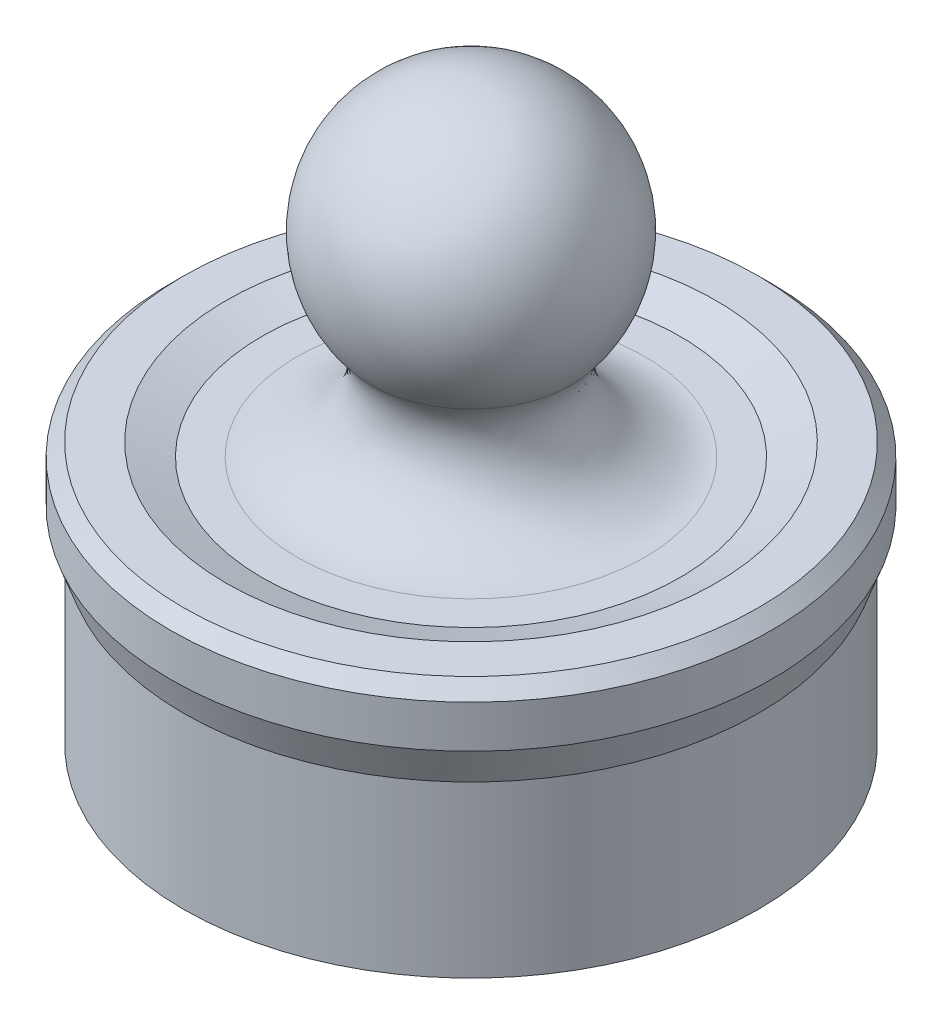
ISO-10303-21;
HEADER;
FILE_DESCRIPTION(('STEP AP214'),'2;1');
FILE_NAME('part.step','',(''),(''),'','','');
FILE_SCHEMA(('AUTOMOTIVE_DESIGN { 1 0 10303 214 1 1 1 1 }'));
ENDSEC;
DATA;
#1=APPLICATION_CONTEXT('core data for automotive mechanical design processes');
#2=APPLICATION_PROTOCOL_DEFINITION('international standard','automotive_design',2000,#1);
#3=PRODUCT_CONTEXT('',#1,'mechanical');
#4=PRODUCT('Part','Part','',(#3));
#5=PRODUCT_RELATED_PRODUCT_CATEGORY('part','',(#4));
#6=PRODUCT_DEFINITION_FORMATION('','',#4);
#7=PRODUCT_DEFINITION_CONTEXT('part definition',#1,'design');
#8=PRODUCT_DEFINITION('design','',#6,#7);
#9=PRODUCT_DEFINITION_SHAPE('','',#8);
#10=(LENGTH_UNIT() NAMED_UNIT(*) SI_UNIT(.MILLI.,.METRE.));
#11=(NAMED_UNIT(*) PLANE_ANGLE_UNIT() SI_UNIT($,.RADIAN.));
#12=(NAMED_UNIT(*) SI_UNIT($,.STERADIAN.) SOLID_ANGLE_UNIT());
#13=UNCERTAINTY_MEASURE_WITH_UNIT(LENGTH_MEASURE(1.E-05),#10,'distance_accuracy_value','');
#14=(GEOMETRIC_REPRESENTATION_CONTEXT(3) GLOBAL_UNCERTAINTY_ASSIGNED_CONTEXT((#13)) GLOBAL_UNIT_ASSIGNED_CONTEXT((#10,
#11,#12)) REPRESENTATION_CONTEXT('',''));
#15=CARTESIAN_POINT('',(0.,0.,0.));
#16=DIRECTION('',(0.,0.,1.));
#17=DIRECTION('',(1.,0.,0.));
#18=AXIS2_PLACEMENT_3D('',#15,#16,#17);
#19=CARTESIAN_POINT('',(-9.,-7.5,0.));
#20=DIRECTION('',(0.,-1.,0.));
#21=DIRECTION('',(0.,0.,-1.));
#22=AXIS2_PLACEMENT_3D('',#19,#20,#21);
#23=PLANE('',#22);
#24=CARTESIAN_POINT('',(0.,-7.5,0.));
#25=DIRECTION('',(0.,1.,0.));
#26=DIRECTION('',(0.,0.,1.));
#27=AXIS2_PLACEMENT_3D('',#24,#25,#26);
#28=CIRCLE('',#27,9.);
#29=CARTESIAN_POINT('',(0.,-7.5,9.));
#30=VERTEX_POINT('',#29);
#31=EDGE_CURVE('E72',#30,#30,#28,.T.);
#32=ORIENTED_EDGE('',*,*,#31,.T.);
#33=EDGE_LOOP('',(#32));
#34=FACE_BOUND('',#33,.T.);
#35=CARTESIAN_POINT('',(0.,-7.5,0.));
#36=DIRECTION('',(0.,1.,0.));
#37=DIRECTION('',(0.,0.,1.));
#38=AXIS2_PLACEMENT_3D('',#35,#36,#37);
#39=CIRCLE('',#38,11.);
#40=CARTESIAN_POINT('',(0.,-7.5,11.));
#41=VERTEX_POINT('',#40);
#42=EDGE_CURVE('E10',#41,#41,#39,.T.);
#43=ORIENTED_EDGE('',*,*,#42,.F.);
#44=EDGE_LOOP('',(#43));
#45=FACE_BOUND('',#44,.T.);
#46=ADVANCED_FACE('F35',(#34,#45),#23,.T.);
#47=CARTESIAN_POINT('',(0.,14.5,0.));
#48=DIRECTION('',(0.,1.,0.));
#49=DIRECTION('',(0.,0.,1.));
#50=AXIS2_PLACEMENT_3D('',#47,#48,#49);
#51=CYLINDRICAL_SURFACE('',#50,11.);
#52=ORIENTED_EDGE('',*,*,#42,.T.);
#53=EDGE_LOOP('',(#52));
#54=FACE_BOUND('',#53,.T.);
#55=CARTESIAN_POINT('',(0.,-0.999999999999999,0.));
#56=DIRECTION('',(0.,1.,0.));
#57=DIRECTION('',(0.,0.,1.));
#58=AXIS2_PLACEMENT_3D('',#55,#56,#57);
#59=CIRCLE('',#58,11.);
#60=CARTESIAN_POINT('',(0.,-0.999999999999999,11.));
#61=VERTEX_POINT('',#60);
#62=EDGE_CURVE('E41',#61,#61,#59,.T.);
#63=ORIENTED_EDGE('',*,*,#62,.F.);
#64=EDGE_LOOP('',(#63));
#65=FACE_BOUND('',#64,.T.);
#66=ADVANCED_FACE('F111',(#54,#65),#51,.T.);
#67=CARTESIAN_POINT('',(0.,0.373738709727334,0.));
#68=DIRECTION('',(0.,1.,0.));
#69=DIRECTION('',(0.,0.,1.));
#70=AXIS2_PLACEMENT_3D('',#67,#68,#69);
#71=CONICAL_SURFACE('',#70,11.5,0.349065850398871);
#72=ORIENTED_EDGE('',*,*,#62,.T.);
#73=EDGE_LOOP('',(#72));
#74=FACE_BOUND('',#73,.T.);
#75=CARTESIAN_POINT('',(0.,0.373738709727334,0.));
#76=DIRECTION('',(0.,1.,0.));
#77=DIRECTION('',(0.,0.,1.));
#78=AXIS2_PLACEMENT_3D('',#75,#76,#77);
#79=CIRCLE('',#78,11.5);
#80=CARTESIAN_POINT('',(0.,0.373738709727334,11.5));
#81=VERTEX_POINT('',#80);
#82=EDGE_CURVE('E45',#81,#81,#79,.T.);
#83=ORIENTED_EDGE('',*,*,#82,.F.);
#84=EDGE_LOOP('',(#83));
#85=FACE_BOUND('',#84,.T.);
#86=ADVANCED_FACE('F108',(#74,#85),#71,.T.);
#87=CARTESIAN_POINT('',(0.,14.5,0.));
#88=DIRECTION('',(0.,1.,0.));
#89=DIRECTION('',(0.,0.,1.));
#90=AXIS2_PLACEMENT_3D('',#87,#88,#89);
#91=CYLINDRICAL_SURFACE('',#90,11.5);
#92=ORIENTED_EDGE('',*,*,#82,.T.);
#93=EDGE_LOOP('',(#92));
#94=FACE_BOUND('',#93,.T.);
#95=CARTESIAN_POINT('',(0.,2.00000000000001,0.));
#96=DIRECTION('',(0.,1.,0.));
#97=DIRECTION('',(0.,0.,1.));
#98=AXIS2_PLACEMENT_3D('',#95,#96,#97);
#99=CIRCLE('',#98,11.5);
#100=CARTESIAN_POINT('',(0.,2.00000000000001,11.5));
#101=VERTEX_POINT('',#100);
#102=EDGE_CURVE('E49',#101,#101,#99,.T.);
#103=ORIENTED_EDGE('',*,*,#102,.F.);
#104=EDGE_LOOP('',(#103));
#105=FACE_BOUND('',#104,.T.);
#106=ADVANCED_FACE('F104',(#94,#105),#91,.T.);
#107=CARTESIAN_POINT('',(0.,2.5,0.));
#108=DIRECTION('',(0.,-1.,0.));
#109=DIRECTION('',(0.,0.,-1.));
#110=AXIS2_PLACEMENT_3D('',#107,#108,#109);
#111=CONICAL_SURFACE('',#110,11.,0.785398163397443);
#112=ORIENTED_EDGE('',*,*,#102,.T.);
#113=EDGE_LOOP('',(#112));
#114=FACE_BOUND('',#113,.T.);
#115=CARTESIAN_POINT('',(0.,2.5,0.));
#116=DIRECTION('',(0.,1.,0.));
#117=DIRECTION('',(0.,0.,1.));
#118=AXIS2_PLACEMENT_3D('',#115,#116,#117);
#119=CIRCLE('',#118,11.);
#120=CARTESIAN_POINT('',(0.,2.5,11.));
#121=VERTEX_POINT('',#120);
#122=EDGE_CURVE('E54',#121,#121,#119,.T.);
#123=ORIENTED_EDGE('',*,*,#122,.F.);
#124=EDGE_LOOP('',(#123));
#125=FACE_BOUND('',#124,.T.);
#126=ADVANCED_FACE('F100',(#114,#125),#111,.T.);
#127=CARTESIAN_POINT('',(-9.37373870972734,2.5,0.));
#128=DIRECTION('',(0.,1.,0.));
#129=DIRECTION('',(0.,0.,1.));
#130=AXIS2_PLACEMENT_3D('',#127,#128,#129);
#131=PLANE('',#130);
#132=ORIENTED_EDGE('',*,*,#122,.T.);
#133=EDGE_LOOP('',(#132));
#134=FACE_BOUND('',#133,.T.);
#135=CARTESIAN_POINT('',(0.,2.5,0.));
#136=DIRECTION('',(0.,1.,0.));
#137=DIRECTION('',(0.,0.,1.));
#138=AXIS2_PLACEMENT_3D('',#135,#136,#137);
#139=CIRCLE('',#138,9.37373870972734);
#140=CARTESIAN_POINT('',(0.,2.5,9.37373870972734));
#141=VERTEX_POINT('',#140);
#142=EDGE_CURVE('E57',#141,#141,#139,.T.);
#143=ORIENTED_EDGE('',*,*,#142,.F.);
#144=EDGE_LOOP('',(#143));
#145=FACE_BOUND('',#144,.T.);
#146=ADVANCED_FACE('F96',(#134,#145),#131,.T.);
#147=CARTESIAN_POINT('',(0.,2.,0.));
#148=DIRECTION('',(0.,1.,0.));
#149=DIRECTION('',(0.,0.,1.));
#150=AXIS2_PLACEMENT_3D('',#147,#148,#149);
#151=CONICAL_SURFACE('',#150,8.,1.22173047639604);
#152=ORIENTED_EDGE('',*,*,#142,.T.);
#153=EDGE_LOOP('',(#152));
#154=FACE_BOUND('',#153,.T.);
#155=CARTESIAN_POINT('',(0.,2.,0.));
#156=DIRECTION('',(0.,1.,0.));
#157=DIRECTION('',(0.,0.,1.));
#158=AXIS2_PLACEMENT_3D('',#155,#156,#157);
#159=CIRCLE('',#158,8.);
#160=CARTESIAN_POINT('',(0.,2.,8.));
#161=VERTEX_POINT('',#160);
#162=EDGE_CURVE('E60',#161,#161,#159,.T.);
#163=ORIENTED_EDGE('',*,*,#162,.F.);
#164=EDGE_LOOP('',(#163));
#165=FACE_BOUND('',#164,.T.);
#166=ADVANCED_FACE('F92',(#154,#165),#151,.F.);
#167=CARTESIAN_POINT('',(-8.,2.,0.));
#168=DIRECTION('',(0.,1.,0.));
#169=DIRECTION('',(0.,0.,1.));
#170=AXIS2_PLACEMENT_3D('',#167,#168,#169);
#171=PLANE('',#170);
#172=ORIENTED_EDGE('',*,*,#162,.T.);
#173=EDGE_LOOP('',(#172));
#174=FACE_BOUND('',#173,.T.);
#175=CARTESIAN_POINT('',(0.,1.99999999999999,0.));
#176=DIRECTION('',(0.,1.,0.));
#177=DIRECTION('',(0.,0.,1.));
#178=AXIS2_PLACEMENT_3D('',#175,#176,#177);
#179=CIRCLE('',#178,6.65525862764819);
#180=CARTESIAN_POINT('',(0.,1.99999999999999,6.65525862764819));
#181=VERTEX_POINT('',#180);
#182=EDGE_CURVE('E63',#181,#181,#179,.T.);
#183=ORIENTED_EDGE('',*,*,#182,.F.);
#184=EDGE_LOOP('',(#183));
#185=FACE_BOUND('',#184,.T.);
#186=ADVANCED_FACE('F87',(#174,#185),#171,.T.);
#187=CARTESIAN_POINT('',(-3.84504348942107,6.30380842807245,0.));
#188=CARTESIAN_POINT('',(-2.95736250864117,5.23592125703775,0.));
#189=CARTESIAN_POINT('',(-3.57690890251755,3.35585886970705,0.));
#190=CARTESIAN_POINT('',(-5.25049025224121,2.29999269878144,0.));
#191=CARTESIAN_POINT('',(-6.12050651857031,1.99999999999999,0.));
#192=CARTESIAN_POINT('',(-6.65525862764819,1.99999999999999,0.));
#193=B_SPLINE_CURVE_WITH_KNOTS('',3,(#187,#188,#189,#190,#191,#192),.UNSPECIFIED.,.F.,.F.,(4,1,
1,4),(0.,0.515237485145415,0.754995782876286,1.),.UNSPECIFIED.);
#194=CARTESIAN_POINT('',(0.,14.5,0.));
#195=DIRECTION('',(0.,1.,0.));
#196=AXIS1_PLACEMENT('',#194,#195);
#197=SURFACE_OF_REVOLUTION('',#193,#196);
#198=ORIENTED_EDGE('',*,*,#182,.T.);
#199=EDGE_LOOP('',(#198));
#200=FACE_BOUND('',#199,.T.);
#201=CARTESIAN_POINT('',(0.,6.30380842807247,0.));
#202=DIRECTION('',(0.,1.,0.));
#203=DIRECTION('',(0.,0.,1.));
#204=AXIS2_PLACEMENT_3D('',#201,#202,#203);
#205=CIRCLE('',#204,3.84504348942106);
#206=CARTESIAN_POINT('',(0.,6.30380842807247,3.84504348942106));
#207=VERTEX_POINT('',#206);
#208=EDGE_CURVE('E66',#207,#207,#205,.T.);
#209=ORIENTED_EDGE('',*,*,#208,.F.);
#210=EDGE_LOOP('',(#209));
#211=FACE_BOUND('',#210,.T.);
#212=ADVANCED_FACE('F82',(#200,#211),#197,.F.);
#213=CARTESIAN_POINT('',(0.,9.5,0.));
#214=DIRECTION('',(0.,1.,0.));
#215=DIRECTION('',(1.,0.,0.));
#216=AXIS2_PLACEMENT_3D('',#213,#214,#215);
#217=SPHERICAL_SURFACE('',#216,4.99999999999998);
#218=ORIENTED_EDGE('',*,*,#208,.T.);
#219=EDGE_LOOP('',(#218));
#220=FACE_BOUND('',#219,.T.);
#221=ADVANCED_FACE('F86',(#220),#217,.T.);
#222=CARTESIAN_POINT('',(-9.,0.,0.));
#223=DIRECTION('',(0.,-1.,0.));
#224=DIRECTION('',(0.,0.,-1.));
#225=AXIS2_PLACEMENT_3D('',#222,#223,#224);
#226=PLANE('',#225);
#227=CARTESIAN_POINT('',(0.,0.,0.));
#228=DIRECTION('',(0.,1.,0.));
#229=DIRECTION('',(0.,0.,1.));
#230=AXIS2_PLACEMENT_3D('',#227,#228,#229);
#231=CIRCLE('',#230,9.);
#232=CARTESIAN_POINT('',(0.,0.,9.));
#233=VERTEX_POINT('',#232);
#234=EDGE_CURVE('E69',#233,#233,#231,.T.);
#235=ORIENTED_EDGE('',*,*,#234,.F.);
#236=EDGE_LOOP('',(#235));
#237=FACE_BOUND('',#236,.T.);
#238=ADVANCED_FACE('F125',(#237),#226,.T.);
#239=CARTESIAN_POINT('',(0.,14.5,0.));
#240=DIRECTION('',(0.,1.,0.));
#241=DIRECTION('',(0.,0.,1.));
#242=AXIS2_PLACEMENT_3D('',#239,#240,#241);
#243=CYLINDRICAL_SURFACE('',#242,9.);
#244=ORIENTED_EDGE('',*,*,#234,.T.);
#245=EDGE_LOOP('',(#244));
#246=FACE_BOUND('',#245,.T.);
#247=ORIENTED_EDGE('',*,*,#31,.F.);
#248=EDGE_LOOP('',(#247));
#249=FACE_BOUND('',#248,.T.);
#250=ADVANCED_FACE('F123',(#246,#249),#243,.F.);
#251=CLOSED_SHELL('',(#46,#66,#86,#106,#126,#146,#166,#186,#212,#221,#238,#250));
#252=MANIFOLD_SOLID_BREP('B2',#251);
#253=ADVANCED_BREP_SHAPE_REPRESENTATION('',(#18,#252),#14);
#254=SHAPE_DEFINITION_REPRESENTATION(#9,#253);
ENDSEC;
END-ISO-10303-21;
